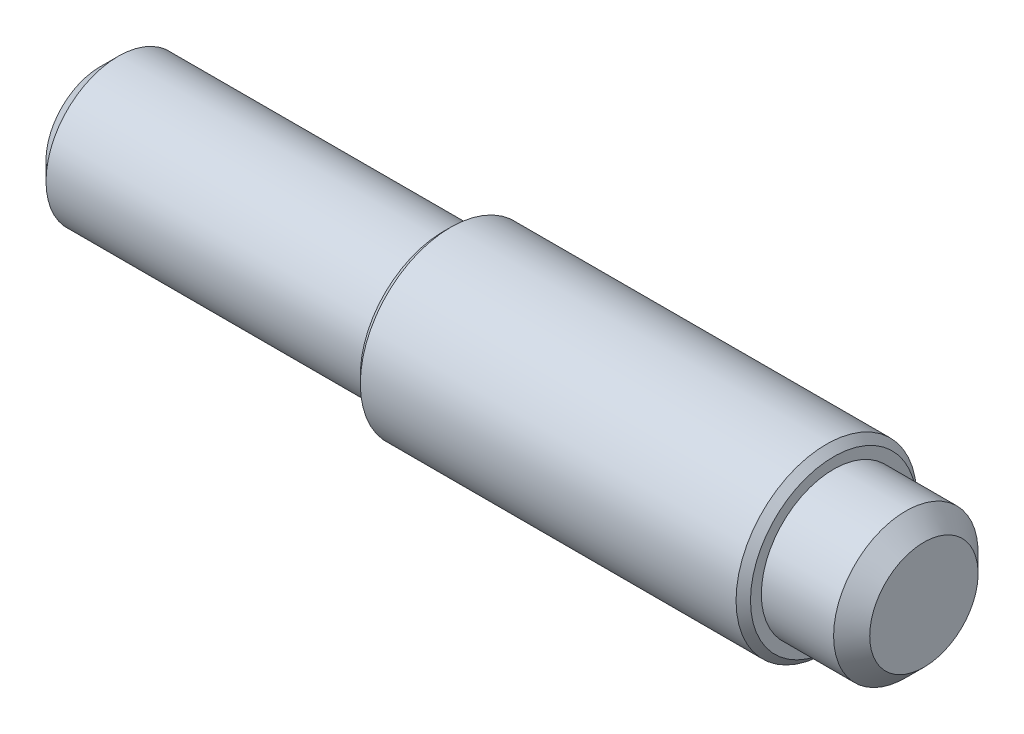
ISO-10303-21;
HEADER;
FILE_DESCRIPTION(('STEP AP214'),'2;1');
FILE_NAME('part.step','',(''),(''),'','','');
FILE_SCHEMA(('AUTOMOTIVE_DESIGN { 1 0 10303 214 1 1 1 1 }'));
ENDSEC;
DATA;
#1=APPLICATION_CONTEXT('core data for automotive mechanical design processes');
#2=APPLICATION_PROTOCOL_DEFINITION('international standard','automotive_design',2000,#1);
#3=PRODUCT_CONTEXT('',#1,'mechanical');
#4=PRODUCT('Part','Part','',(#3));
#5=PRODUCT_RELATED_PRODUCT_CATEGORY('part','',(#4));
#6=PRODUCT_DEFINITION_FORMATION('','',#4);
#7=PRODUCT_DEFINITION_CONTEXT('part definition',#1,'design');
#8=PRODUCT_DEFINITION('design','',#6,#7);
#9=PRODUCT_DEFINITION_SHAPE('','',#8);
#10=(LENGTH_UNIT() NAMED_UNIT(*) SI_UNIT(.MILLI.,.METRE.));
#11=(NAMED_UNIT(*) PLANE_ANGLE_UNIT() SI_UNIT($,.RADIAN.));
#12=(NAMED_UNIT(*) SI_UNIT($,.STERADIAN.) SOLID_ANGLE_UNIT());
#13=UNCERTAINTY_MEASURE_WITH_UNIT(LENGTH_MEASURE(1.E-05),#10,'distance_accuracy_value','');
#14=(GEOMETRIC_REPRESENTATION_CONTEXT(3) GLOBAL_UNCERTAINTY_ASSIGNED_CONTEXT((#13)) GLOBAL_UNIT_ASSIGNED_CONTEXT((#10,
#11,#12)) REPRESENTATION_CONTEXT('',''));
#15=CARTESIAN_POINT('',(0.,0.,0.));
#16=DIRECTION('',(0.,0.,1.));
#17=DIRECTION('',(1.,0.,0.));
#18=AXIS2_PLACEMENT_3D('',#15,#16,#17);
#19=CARTESIAN_POINT('',(-92.,2.5,0.));
#20=DIRECTION('',(1.,0.,0.));
#21=DIRECTION('',(0.,0.,-1.));
#22=AXIS2_PLACEMENT_3D('',#19,#20,#21);
#23=PLANE('',#22);
#24=CARTESIAN_POINT('',(-92.,0.,0.));
#25=DIRECTION('',(1.,0.,0.));
#26=DIRECTION('',(0.,0.,-1.));
#27=AXIS2_PLACEMENT_3D('',#24,#25,#26);
#28=CIRCLE('',#27,2.3);
#29=CARTESIAN_POINT('',(-92.,0.,-2.3));
#30=VERTEX_POINT('',#29);
#31=EDGE_CURVE('E44',#30,#30,#28,.F.);
#32=ORIENTED_EDGE('',*,*,#31,.T.);
#33=EDGE_LOOP('',(#32));
#34=FACE_BOUND('',#33,.T.);
#35=CARTESIAN_POINT('',(-92.,0.,0.));
#36=DIRECTION('',(-1.,0.,0.));
#37=DIRECTION('',(0.,0.,1.));
#38=AXIS2_PLACEMENT_3D('',#35,#36,#37);
#39=CIRCLE('',#38,2.);
#40=CARTESIAN_POINT('',(-92.,0.,2.));
#41=VERTEX_POINT('',#40);
#42=EDGE_CURVE('E47',#41,#41,#39,.T.);
#43=ORIENTED_EDGE('',*,*,#42,.F.);
#44=EDGE_LOOP('',(#43));
#45=FACE_BOUND('',#44,.T.);
#46=ADVANCED_FACE('F15',(#34,#45),#23,.F.);
#47=CARTESIAN_POINT('',(-100.,0.,0.));
#48=DIRECTION('',(-1.,0.,0.));
#49=DIRECTION('',(0.,0.,1.));
#50=AXIS2_PLACEMENT_3D('',#47,#48,#49);
#51=CYLINDRICAL_SURFACE('',#50,2.);
#52=CARTESIAN_POINT('',(-101.,0.,0.));
#53=DIRECTION('',(1.,0.,0.));
#54=DIRECTION('',(0.,0.,-1.));
#55=AXIS2_PLACEMENT_3D('',#52,#53,#54);
#56=CIRCLE('',#55,2.);
#57=CARTESIAN_POINT('',(-101.,0.,-2.));
#58=VERTEX_POINT('',#57);
#59=EDGE_CURVE('E26',#58,#58,#56,.T.);
#60=ORIENTED_EDGE('',*,*,#59,.T.);
#61=EDGE_LOOP('',(#60));
#62=FACE_BOUND('',#61,.T.);
#63=ORIENTED_EDGE('',*,*,#42,.T.);
#64=EDGE_LOOP('',(#63));
#65=FACE_BOUND('',#64,.T.);
#66=ADVANCED_FACE('F71',(#62,#65),#51,.T.);
#67=CARTESIAN_POINT('',(-101.5,2.00000066397581,2.75027785274994E-07));
#68=DIRECTION('',(1.,0.,0.));
#69=DIRECTION('',(0.,0.,-1.));
#70=AXIS2_PLACEMENT_3D('',#67,#68,#69);
#71=PLANE('',#70);
#72=CARTESIAN_POINT('',(-101.5,0.,0.));
#73=DIRECTION('',(1.,0.,0.));
#74=DIRECTION('',(0.,0.,-1.));
#75=AXIS2_PLACEMENT_3D('',#72,#73,#74);
#76=CIRCLE('',#75,1.5);
#77=CARTESIAN_POINT('',(-101.5,0.,-1.5));
#78=VERTEX_POINT('',#77);
#79=EDGE_CURVE('E30',#78,#78,#76,.F.);
#80=ORIENTED_EDGE('',*,*,#79,.T.);
#81=EDGE_LOOP('',(#80));
#82=FACE_BOUND('',#81,.T.);
#83=ADVANCED_FACE('F68',(#82),#71,.F.);
#84=CARTESIAN_POINT('',(-78.7,0.,0.));
#85=DIRECTION('',(-1.,0.,0.));
#86=DIRECTION('',(0.,0.,1.));
#87=AXIS2_PLACEMENT_3D('',#84,#85,#86);
#88=PLANE('',#87);
#89=CARTESIAN_POINT('',(-78.7,0.,0.));
#90=DIRECTION('',(-1.,0.,0.));
#91=DIRECTION('',(0.,0.,1.));
#92=AXIS2_PLACEMENT_3D('',#89,#90,#91);
#93=CIRCLE('',#92,1.5);
#94=CARTESIAN_POINT('',(-78.7,0.,1.5));
#95=VERTEX_POINT('',#94);
#96=EDGE_CURVE('E10',#95,#95,#93,.F.);
#97=ORIENTED_EDGE('',*,*,#96,.T.);
#98=EDGE_LOOP('',(#97));
#99=FACE_BOUND('',#98,.T.);
#100=ADVANCED_FACE('F58',(#99),#88,.F.);
#101=CARTESIAN_POINT('',(-100.,0.,0.));
#102=DIRECTION('',(-1.,0.,0.));
#103=DIRECTION('',(0.,0.,1.));
#104=AXIS2_PLACEMENT_3D('',#101,#102,#103);
#105=CYLINDRICAL_SURFACE('',#104,2.);
#106=CARTESIAN_POINT('',(-79.2,0.,0.));
#107=DIRECTION('',(-1.,0.,0.));
#108=DIRECTION('',(0.,0.,1.));
#109=AXIS2_PLACEMENT_3D('',#106,#107,#108);
#110=CIRCLE('',#109,2.);
#111=CARTESIAN_POINT('',(-79.2,0.,2.));
#112=VERTEX_POINT('',#111);
#113=EDGE_CURVE('E22',#112,#112,#110,.T.);
#114=ORIENTED_EDGE('',*,*,#113,.T.);
#115=EDGE_LOOP('',(#114));
#116=FACE_BOUND('',#115,.T.);
#117=CARTESIAN_POINT('',(-81.2,0.,0.));
#118=DIRECTION('',(-1.,0.,0.));
#119=DIRECTION('',(0.,0.,1.));
#120=AXIS2_PLACEMENT_3D('',#117,#118,#119);
#121=CIRCLE('',#120,2.);
#122=CARTESIAN_POINT('',(-81.2,0.,2.));
#123=VERTEX_POINT('',#122);
#124=EDGE_CURVE('E50',#123,#123,#121,.T.);
#125=ORIENTED_EDGE('',*,*,#124,.F.);
#126=EDGE_LOOP('',(#125));
#127=FACE_BOUND('',#126,.T.);
#128=ADVANCED_FACE('F56',(#116,#127),#105,.T.);
#129=CARTESIAN_POINT('',(-81.2,2.,0.));
#130=DIRECTION('',(-1.,0.,0.));
#131=DIRECTION('',(0.,0.,1.));
#132=AXIS2_PLACEMENT_3D('',#129,#130,#131);
#133=PLANE('',#132);
#134=CARTESIAN_POINT('',(-81.2,0.,0.));
#135=DIRECTION('',(-1.,0.,0.));
#136=DIRECTION('',(0.,0.,1.));
#137=AXIS2_PLACEMENT_3D('',#134,#135,#136);
#138=CIRCLE('',#137,2.3);
#139=CARTESIAN_POINT('',(-81.2,0.,2.3));
#140=VERTEX_POINT('',#139);
#141=EDGE_CURVE('E35',#140,#140,#138,.F.);
#142=ORIENTED_EDGE('',*,*,#141,.T.);
#143=EDGE_LOOP('',(#142));
#144=FACE_BOUND('',#143,.T.);
#145=ORIENTED_EDGE('',*,*,#124,.T.);
#146=EDGE_LOOP('',(#145));
#147=FACE_BOUND('',#146,.T.);
#148=ADVANCED_FACE('F54',(#144,#147),#133,.F.);
#149=CARTESIAN_POINT('',(-100.,0.,0.));
#150=DIRECTION('',(-1.,0.,0.));
#151=DIRECTION('',(0.,0.,1.));
#152=AXIS2_PLACEMENT_3D('',#149,#150,#151);
#153=CYLINDRICAL_SURFACE('',#152,2.5);
#154=CARTESIAN_POINT('',(-91.8,0.,0.));
#155=DIRECTION('',(1.,0.,0.));
#156=DIRECTION('',(0.,0.,-1.));
#157=AXIS2_PLACEMENT_3D('',#154,#155,#156);
#158=CIRCLE('',#157,2.5);
#159=CARTESIAN_POINT('',(-91.8,0.,-2.5));
#160=VERTEX_POINT('',#159);
#161=EDGE_CURVE('E38',#160,#160,#158,.T.);
#162=ORIENTED_EDGE('',*,*,#161,.T.);
#163=EDGE_LOOP('',(#162));
#164=FACE_BOUND('',#163,.T.);
#165=CARTESIAN_POINT('',(-81.4,0.,0.));
#166=DIRECTION('',(-1.,0.,0.));
#167=DIRECTION('',(0.,0.,1.));
#168=AXIS2_PLACEMENT_3D('',#165,#166,#167);
#169=CIRCLE('',#168,2.5);
#170=CARTESIAN_POINT('',(-81.4,0.,2.5));
#171=VERTEX_POINT('',#170);
#172=EDGE_CURVE('E41',#171,#171,#169,.T.);
#173=ORIENTED_EDGE('',*,*,#172,.T.);
#174=EDGE_LOOP('',(#173));
#175=FACE_BOUND('',#174,.T.);
#176=ADVANCED_FACE('F65',(#164,#175),#153,.T.);
#177=CARTESIAN_POINT('',(-92.,0.,0.));
#178=DIRECTION('',(1.,0.,0.));
#179=DIRECTION('',(0.,0.,-1.));
#180=AXIS2_PLACEMENT_3D('',#177,#178,#179);
#181=CONICAL_SURFACE('',#180,2.3,0.785398163397434);
#182=ORIENTED_EDGE('',*,*,#161,.F.);
#183=EDGE_LOOP('',(#182));
#184=FACE_BOUND('',#183,.T.);
#185=ORIENTED_EDGE('',*,*,#31,.F.);
#186=EDGE_LOOP('',(#185));
#187=FACE_BOUND('',#186,.T.);
#188=ADVANCED_FACE('F81',(#184,#187),#181,.T.);
#189=CARTESIAN_POINT('',(-81.4,0.,0.));
#190=DIRECTION('',(-1.,0.,0.));
#191=DIRECTION('',(0.,0.,1.));
#192=AXIS2_PLACEMENT_3D('',#189,#190,#191);
#193=CONICAL_SURFACE('',#192,2.5,0.785398163397434);
#194=ORIENTED_EDGE('',*,*,#141,.F.);
#195=EDGE_LOOP('',(#194));
#196=FACE_BOUND('',#195,.T.);
#197=ORIENTED_EDGE('',*,*,#172,.F.);
#198=EDGE_LOOP('',(#197));
#199=FACE_BOUND('',#198,.T.);
#200=ADVANCED_FACE('F84',(#196,#199),#193,.T.);
#201=CARTESIAN_POINT('',(-101.5,0.,0.));
#202=DIRECTION('',(1.,0.,0.));
#203=DIRECTION('',(0.,0.,-1.));
#204=AXIS2_PLACEMENT_3D('',#201,#202,#203);
#205=CONICAL_SURFACE('',#204,1.5,0.785398163397448);
#206=ORIENTED_EDGE('',*,*,#59,.F.);
#207=EDGE_LOOP('',(#206));
#208=FACE_BOUND('',#207,.T.);
#209=ORIENTED_EDGE('',*,*,#79,.F.);
#210=EDGE_LOOP('',(#209));
#211=FACE_BOUND('',#210,.T.);
#212=ADVANCED_FACE('F88',(#208,#211),#205,.T.);
#213=CARTESIAN_POINT('',(-79.2,0.,0.));
#214=DIRECTION('',(-1.,0.,0.));
#215=DIRECTION('',(0.,0.,1.));
#216=AXIS2_PLACEMENT_3D('',#213,#214,#215);
#217=CONICAL_SURFACE('',#216,2.,0.785398163397448);
#218=ORIENTED_EDGE('',*,*,#96,.F.);
#219=EDGE_LOOP('',(#218));
#220=FACE_BOUND('',#219,.T.);
#221=ORIENTED_EDGE('',*,*,#113,.F.);
#222=EDGE_LOOP('',(#221));
#223=FACE_BOUND('',#222,.T.);
#224=ADVANCED_FACE('F17',(#220,#223),#217,.T.);
#225=CLOSED_SHELL('',(#46,#66,#83,#100,#128,#148,#176,#188,#200,#212,#224));
#226=MANIFOLD_SOLID_BREP('B1',#225);
#227=ADVANCED_BREP_SHAPE_REPRESENTATION('',(#18,#226),#14);
#228=SHAPE_DEFINITION_REPRESENTATION(#9,#227);
ENDSEC;
END-ISO-10303-21;
